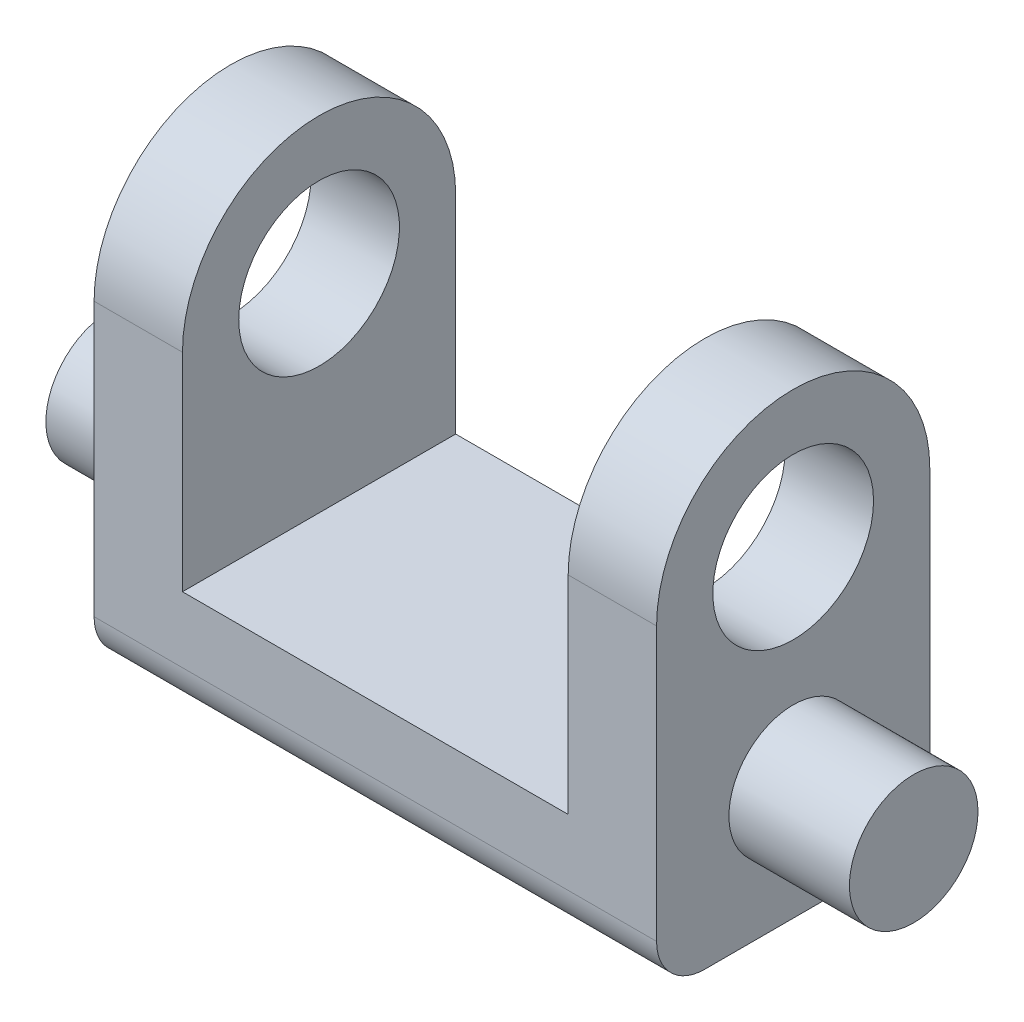
ISO-10303-21;
HEADER;
FILE_DESCRIPTION(('STEP AP214'),'2;1');
FILE_NAME('part.step','',(''),(''),'','','');
FILE_SCHEMA(('AUTOMOTIVE_DESIGN { 1 0 10303 214 1 1 1 1 }'));
ENDSEC;
DATA;
#1=APPLICATION_CONTEXT('core data for automotive mechanical design processes');
#2=APPLICATION_PROTOCOL_DEFINITION('international standard','automotive_design',2000,#1);
#3=PRODUCT_CONTEXT('',#1,'mechanical');
#4=PRODUCT('Part','Part','',(#3));
#5=PRODUCT_RELATED_PRODUCT_CATEGORY('part','',(#4));
#6=PRODUCT_DEFINITION_FORMATION('','',#4);
#7=PRODUCT_DEFINITION_CONTEXT('part definition',#1,'design');
#8=PRODUCT_DEFINITION('design','',#6,#7);
#9=PRODUCT_DEFINITION_SHAPE('','',#8);
#10=(LENGTH_UNIT() NAMED_UNIT(*) SI_UNIT(.MILLI.,.METRE.));
#11=(NAMED_UNIT(*) PLANE_ANGLE_UNIT() SI_UNIT($,.RADIAN.));
#12=(NAMED_UNIT(*) SI_UNIT($,.STERADIAN.) SOLID_ANGLE_UNIT());
#13=UNCERTAINTY_MEASURE_WITH_UNIT(LENGTH_MEASURE(1.E-05),#10,'distance_accuracy_value','');
#14=(GEOMETRIC_REPRESENTATION_CONTEXT(3) GLOBAL_UNCERTAINTY_ASSIGNED_CONTEXT((#13)) GLOBAL_UNIT_ASSIGNED_CONTEXT((#10,
#11,#12)) REPRESENTATION_CONTEXT('',''));
#15=CARTESIAN_POINT('',(0.,0.,0.));
#16=DIRECTION('',(0.,0.,1.));
#17=DIRECTION('',(1.,0.,0.));
#18=AXIS2_PLACEMENT_3D('',#15,#16,#17);
#19=CARTESIAN_POINT('',(35.,25.,0.));
#20=DIRECTION('',(-1.,0.,0.));
#21=DIRECTION('',(0.,0.,1.));
#22=AXIS2_PLACEMENT_3D('',#19,#20,#21);
#23=CYLINDRICAL_SURFACE('',#22,17.);
#24=DIRECTION('',(-1.,0.,0.));
#25=VECTOR('',#24,1.);
#26=CARTESIAN_POINT('',(35.,25.,17.));
#27=LINE('',#26,#25);
#28=CARTESIAN_POINT('',(-24.,25.,17.));
#29=VERTEX_POINT('',#28);
#30=CARTESIAN_POINT('',(-35.,25.,17.));
#31=VERTEX_POINT('',#30);
#32=EDGE_CURVE('E156',#29,#31,#27,.T.);
#33=ORIENTED_EDGE('',*,*,#32,.F.);
#34=CARTESIAN_POINT('',(-24.,25.,0.));
#35=DIRECTION('',(-1.,0.,0.));
#36=DIRECTION('',(0.,0.,1.));
#37=AXIS2_PLACEMENT_3D('',#34,#35,#36);
#38=CIRCLE('',#37,17.);
#39=CARTESIAN_POINT('',(-24.,25.,-17.));
#40=VERTEX_POINT('',#39);
#41=EDGE_CURVE('E185',#29,#40,#38,.T.);
#42=ORIENTED_EDGE('',*,*,#41,.T.);
#43=DIRECTION('',(-1.,0.,0.));
#44=VECTOR('',#43,1.);
#45=CARTESIAN_POINT('',(35.,25.,-17.));
#46=LINE('',#45,#44);
#47=CARTESIAN_POINT('',(-35.,25.,-17.));
#48=VERTEX_POINT('',#47);
#49=EDGE_CURVE('E88',#40,#48,#46,.T.);
#50=ORIENTED_EDGE('',*,*,#49,.T.);
#51=CARTESIAN_POINT('',(-35.,25.,0.));
#52=DIRECTION('',(1.,0.,0.));
#53=DIRECTION('',(0.,0.,-1.));
#54=AXIS2_PLACEMENT_3D('',#51,#52,#53);
#55=CIRCLE('',#54,17.);
#56=EDGE_CURVE('E135',#48,#31,#55,.T.);
#57=ORIENTED_EDGE('',*,*,#56,.T.);
#58=EDGE_LOOP('',(#33,#42,#50,#57));
#59=FACE_BOUND('',#58,.T.);
#60=ADVANCED_FACE('F34',(#59),#23,.T.);
#61=CARTESIAN_POINT('',(35.,25.,0.));
#62=DIRECTION('',(-1.,0.,0.));
#63=DIRECTION('',(0.,0.,1.));
#64=AXIS2_PLACEMENT_3D('',#61,#62,#63);
#65=CYLINDRICAL_SURFACE('',#64,10.);
#66=CARTESIAN_POINT('',(-24.,25.,0.));
#67=DIRECTION('',(-1.,0.,0.));
#68=DIRECTION('',(0.,0.,1.));
#69=AXIS2_PLACEMENT_3D('',#66,#67,#68);
#70=CIRCLE('',#69,10.);
#71=CARTESIAN_POINT('',(-24.,25.,10.));
#72=VERTEX_POINT('',#71);
#73=EDGE_CURVE('E38',#72,#72,#70,.T.);
#74=ORIENTED_EDGE('',*,*,#73,.F.);
#75=EDGE_LOOP('',(#74));
#76=FACE_BOUND('',#75,.T.);
#77=CARTESIAN_POINT('',(-35.,25.,0.));
#78=DIRECTION('',(1.,0.,0.));
#79=DIRECTION('',(0.,0.,-1.));
#80=AXIS2_PLACEMENT_3D('',#77,#78,#79);
#81=CIRCLE('',#80,10.);
#82=CARTESIAN_POINT('',(-35.,25.,-10.));
#83=VERTEX_POINT('',#82);
#84=EDGE_CURVE('E187',#83,#83,#81,.T.);
#85=ORIENTED_EDGE('',*,*,#84,.F.);
#86=EDGE_LOOP('',(#85));
#87=FACE_BOUND('',#86,.T.);
#88=ADVANCED_FACE('F251',(#76,#87),#65,.F.);
#89=CARTESIAN_POINT('',(50.,0.,0.));
#90=DIRECTION('',(-1.,0.,0.));
#91=DIRECTION('',(0.,0.,1.));
#92=AXIS2_PLACEMENT_3D('',#89,#90,#91);
#93=CYLINDRICAL_SURFACE('',#92,8.);
#94=CARTESIAN_POINT('',(35.,0.,0.));
#95=DIRECTION('',(1.,0.,0.));
#96=DIRECTION('',(0.,0.,-1.));
#97=AXIS2_PLACEMENT_3D('',#94,#95,#96);
#98=CIRCLE('',#97,8.);
#99=CARTESIAN_POINT('',(35.,0.,-8.));
#100=VERTEX_POINT('',#99);
#101=EDGE_CURVE('E159',#100,#100,#98,.T.);
#102=ORIENTED_EDGE('',*,*,#101,.T.);
#103=EDGE_LOOP('',(#102));
#104=FACE_BOUND('',#103,.T.);
#105=CARTESIAN_POINT('',(50.,0.,0.));
#106=DIRECTION('',(1.,0.,0.));
#107=DIRECTION('',(0.,0.,-1.));
#108=AXIS2_PLACEMENT_3D('',#105,#106,#107);
#109=CIRCLE('',#108,8.);
#110=CARTESIAN_POINT('',(50.,0.,-8.));
#111=VERTEX_POINT('',#110);
#112=EDGE_CURVE('E43',#111,#111,#109,.T.);
#113=ORIENTED_EDGE('',*,*,#112,.F.);
#114=EDGE_LOOP('',(#113));
#115=FACE_BOUND('',#114,.T.);
#116=ADVANCED_FACE('F36',(#104,#115),#93,.T.);
#117=CARTESIAN_POINT('',(50.,0.,0.));
#118=DIRECTION('',(1.,0.,0.));
#119=DIRECTION('',(0.,0.,-1.));
#120=AXIS2_PLACEMENT_3D('',#117,#118,#119);
#121=PLANE('',#120);
#122=ORIENTED_EDGE('',*,*,#112,.T.);
#123=EDGE_LOOP('',(#122));
#124=FACE_BOUND('',#123,.T.);
#125=ADVANCED_FACE('F271',(#124),#121,.T.);
#126=CARTESIAN_POINT('',(35.,25.,0.));
#127=DIRECTION('',(1.,0.,0.));
#128=DIRECTION('',(0.,0.,-1.));
#129=AXIS2_PLACEMENT_3D('',#126,#127,#128);
#130=PLANE('',#129);
#131=CARTESIAN_POINT('',(35.,25.,0.));
#132=DIRECTION('',(1.,0.,0.));
#133=DIRECTION('',(0.,0.,-1.));
#134=AXIS2_PLACEMENT_3D('',#131,#132,#133);
#135=CIRCLE('',#134,10.);
#136=CARTESIAN_POINT('',(35.,25.,-10.));
#137=VERTEX_POINT('',#136);
#138=EDGE_CURVE('E138',#137,#137,#135,.T.);
#139=ORIENTED_EDGE('',*,*,#138,.F.);
#140=EDGE_LOOP('',(#139));
#141=FACE_BOUND('',#140,.T.);
#142=CARTESIAN_POINT('',(35.,25.,0.));
#143=DIRECTION('',(1.,0.,0.));
#144=DIRECTION('',(0.,0.,-1.));
#145=AXIS2_PLACEMENT_3D('',#142,#143,#144);
#146=CIRCLE('',#145,17.);
#147=CARTESIAN_POINT('',(35.,25.,-17.));
#148=VERTEX_POINT('',#147);
#149=CARTESIAN_POINT('',(35.,25.,17.));
#150=VERTEX_POINT('',#149);
#151=EDGE_CURVE('E147',#148,#150,#146,.T.);
#152=ORIENTED_EDGE('',*,*,#151,.T.);
#153=DIRECTION('',(0.,-1.,0.));
#154=VECTOR('',#153,1.);
#155=CARTESIAN_POINT('',(35.,25.,17.));
#156=LINE('',#155,#154);
#157=CARTESIAN_POINT('',(35.,-9.,17.));
#158=VERTEX_POINT('',#157);
#159=EDGE_CURVE('E97',#150,#158,#156,.T.);
#160=ORIENTED_EDGE('',*,*,#159,.T.);
#161=CARTESIAN_POINT('',(35.,-9.,11.));
#162=DIRECTION('',(1.,0.,0.));
#163=DIRECTION('',(0.,0.,-1.));
#164=AXIS2_PLACEMENT_3D('',#161,#162,#163);
#165=CIRCLE('',#164,6.);
#166=CARTESIAN_POINT('',(35.,-15.,11.));
#167=VERTEX_POINT('',#166);
#168=EDGE_CURVE('E114',#158,#167,#165,.T.);
#169=ORIENTED_EDGE('',*,*,#168,.T.);
#170=DIRECTION('',(0.,0.,-1.));
#171=VECTOR('',#170,1.);
#172=CARTESIAN_POINT('',(35.,-15.,11.));
#173=LINE('',#172,#171);
#174=CARTESIAN_POINT('',(35.,-15.,-11.));
#175=VERTEX_POINT('',#174);
#176=EDGE_CURVE('E106',#167,#175,#173,.T.);
#177=ORIENTED_EDGE('',*,*,#176,.T.);
#178=CARTESIAN_POINT('',(35.,-9.,-11.));
#179=DIRECTION('',(1.,0.,0.));
#180=DIRECTION('',(0.,0.,-1.));
#181=AXIS2_PLACEMENT_3D('',#178,#179,#180);
#182=CIRCLE('',#181,6.);
#183=CARTESIAN_POINT('',(35.,-9.,-17.));
#184=VERTEX_POINT('',#183);
#185=EDGE_CURVE('E111',#175,#184,#182,.T.);
#186=ORIENTED_EDGE('',*,*,#185,.T.);
#187=DIRECTION('',(0.,1.,0.));
#188=VECTOR('',#187,1.);
#189=CARTESIAN_POINT('',(35.,-9.,-17.));
#190=LINE('',#189,#188);
#191=EDGE_CURVE('E60',#184,#148,#190,.T.);
#192=ORIENTED_EDGE('',*,*,#191,.T.);
#193=EDGE_LOOP('',(#152,#160,#169,#177,#186,#192));
#194=FACE_BOUND('',#193,.T.);
#195=ORIENTED_EDGE('',*,*,#101,.F.);
#196=EDGE_LOOP('',(#195));
#197=FACE_BOUND('',#196,.T.);
#198=ADVANCED_FACE('F108',(#141,#194,#197),#130,.T.);
#199=CARTESIAN_POINT('',(-35.,25.,0.));
#200=DIRECTION('',(1.,0.,0.));
#201=DIRECTION('',(0.,0.,-1.));
#202=AXIS2_PLACEMENT_3D('',#199,#200,#201);
#203=PLANE('',#202);
#204=ORIENTED_EDGE('',*,*,#84,.T.);
#205=EDGE_LOOP('',(#204));
#206=FACE_BOUND('',#205,.T.);
#207=ORIENTED_EDGE('',*,*,#56,.F.);
#208=DIRECTION('',(0.,1.,0.));
#209=VECTOR('',#208,1.);
#210=CARTESIAN_POINT('',(-35.,-9.,-17.));
#211=LINE('',#210,#209);
#212=CARTESIAN_POINT('',(-35.,-9.,-17.));
#213=VERTEX_POINT('',#212);
#214=EDGE_CURVE('E145',#213,#48,#211,.T.);
#215=ORIENTED_EDGE('',*,*,#214,.F.);
#216=CARTESIAN_POINT('',(-35.,-9.,-11.));
#217=DIRECTION('',(1.,0.,0.));
#218=DIRECTION('',(0.,0.,-1.));
#219=AXIS2_PLACEMENT_3D('',#216,#217,#218);
#220=CIRCLE('',#219,6.);
#221=CARTESIAN_POINT('',(-35.,-15.,-11.));
#222=VERTEX_POINT('',#221);
#223=EDGE_CURVE('E143',#222,#213,#220,.T.);
#224=ORIENTED_EDGE('',*,*,#223,.F.);
#225=DIRECTION('',(0.,0.,-1.));
#226=VECTOR('',#225,1.);
#227=CARTESIAN_POINT('',(-35.,-15.,11.));
#228=LINE('',#227,#226);
#229=CARTESIAN_POINT('',(-35.,-15.,11.));
#230=VERTEX_POINT('',#229);
#231=EDGE_CURVE('E123',#230,#222,#228,.T.);
#232=ORIENTED_EDGE('',*,*,#231,.F.);
#233=CARTESIAN_POINT('',(-35.,-9.,11.));
#234=DIRECTION('',(1.,0.,0.));
#235=DIRECTION('',(0.,0.,-1.));
#236=AXIS2_PLACEMENT_3D('',#233,#234,#235);
#237=CIRCLE('',#236,6.);
#238=CARTESIAN_POINT('',(-35.,-9.,17.));
#239=VERTEX_POINT('',#238);
#240=EDGE_CURVE('E140',#239,#230,#237,.T.);
#241=ORIENTED_EDGE('',*,*,#240,.F.);
#242=DIRECTION('',(0.,-1.,0.));
#243=VECTOR('',#242,1.);
#244=CARTESIAN_POINT('',(-35.,25.,17.));
#245=LINE('',#244,#243);
#246=EDGE_CURVE('E137',#31,#239,#245,.T.);
#247=ORIENTED_EDGE('',*,*,#246,.F.);
#248=EDGE_LOOP('',(#207,#215,#224,#232,#241,#247));
#249=FACE_BOUND('',#248,.T.);
#250=CARTESIAN_POINT('',(-35.,0.,0.));
#251=DIRECTION('',(1.,0.,0.));
#252=DIRECTION('',(0.,0.,-1.));
#253=AXIS2_PLACEMENT_3D('',#250,#251,#252);
#254=CIRCLE('',#253,8.);
#255=CARTESIAN_POINT('',(-35.,0.,-8.));
#256=VERTEX_POINT('',#255);
#257=EDGE_CURVE('E11',#256,#256,#254,.T.);
#258=ORIENTED_EDGE('',*,*,#257,.T.);
#259=EDGE_LOOP('',(#258));
#260=FACE_BOUND('',#259,.T.);
#261=ADVANCED_FACE('F203',(#206,#249,#260),#203,.F.);
#262=CARTESIAN_POINT('',(24.,25.,-17.));
#263=VERTEX_POINT('',#262);
#264=EDGE_CURVE('E148',#148,#263,#46,.T.);
#265=ORIENTED_EDGE('',*,*,#264,.T.);
#266=CARTESIAN_POINT('',(24.,25.,0.));
#267=DIRECTION('',(1.,0.,0.));
#268=DIRECTION('',(0.,0.,-1.));
#269=AXIS2_PLACEMENT_3D('',#266,#267,#268);
#270=CIRCLE('',#269,17.);
#271=CARTESIAN_POINT('',(24.,25.,17.));
#272=VERTEX_POINT('',#271);
#273=EDGE_CURVE('E168',#263,#272,#270,.T.);
#274=ORIENTED_EDGE('',*,*,#273,.T.);
#275=EDGE_CURVE('E157',#150,#272,#27,.T.);
#276=ORIENTED_EDGE('',*,*,#275,.F.);
#277=ORIENTED_EDGE('',*,*,#151,.F.);
#278=EDGE_LOOP('',(#265,#274,#276,#277));
#279=FACE_BOUND('',#278,.T.);
#280=ADVANCED_FACE('F211',(#279),#23,.T.);
#281=CARTESIAN_POINT('',(35.,25.,17.));
#282=DIRECTION('',(0.,0.,-1.));
#283=DIRECTION('',(0.,1.,0.));
#284=AXIS2_PLACEMENT_3D('',#281,#282,#283);
#285=PLANE('',#284);
#286=DIRECTION('',(1.,0.,0.));
#287=VECTOR('',#286,1.);
#288=CARTESIAN_POINT('',(-24.,-0.813252043947445,17.));
#289=LINE('',#288,#287);
#290=CARTESIAN_POINT('',(-24.,-0.813252043947445,17.));
#291=VERTEX_POINT('',#290);
#292=CARTESIAN_POINT('',(24.,-0.813252043947445,17.));
#293=VERTEX_POINT('',#292);
#294=EDGE_CURVE('E235',#291,#293,#289,.T.);
#295=ORIENTED_EDGE('',*,*,#294,.F.);
#296=DIRECTION('',(0.,-1.,0.));
#297=VECTOR('',#296,1.);
#298=CARTESIAN_POINT('',(-24.,-0.813252043947445,17.));
#299=LINE('',#298,#297);
#300=EDGE_CURVE('E238',#29,#291,#299,.T.);
#301=ORIENTED_EDGE('',*,*,#300,.F.);
#302=ORIENTED_EDGE('',*,*,#32,.T.);
#303=ORIENTED_EDGE('',*,*,#246,.T.);
#304=DIRECTION('',(-1.,0.,0.));
#305=VECTOR('',#304,1.);
#306=CARTESIAN_POINT('',(35.,-9.,17.));
#307=LINE('',#306,#305);
#308=EDGE_CURVE('E153',#158,#239,#307,.T.);
#309=ORIENTED_EDGE('',*,*,#308,.F.);
#310=ORIENTED_EDGE('',*,*,#159,.F.);
#311=ORIENTED_EDGE('',*,*,#275,.T.);
#312=DIRECTION('',(0.,1.,0.));
#313=VECTOR('',#312,1.);
#314=CARTESIAN_POINT('',(24.,-0.813252043947445,17.));
#315=LINE('',#314,#313);
#316=EDGE_CURVE('E182',#293,#272,#315,.T.);
#317=ORIENTED_EDGE('',*,*,#316,.F.);
#318=EDGE_LOOP('',(#295,#301,#302,#303,#309,#310,#311,#317));
#319=FACE_BOUND('',#318,.T.);
#320=ADVANCED_FACE('F196',(#319),#285,.F.);
#321=CARTESIAN_POINT('',(35.,-9.,11.));
#322=DIRECTION('',(-1.,0.,0.));
#323=DIRECTION('',(0.,0.,1.));
#324=AXIS2_PLACEMENT_3D('',#321,#322,#323);
#325=CYLINDRICAL_SURFACE('',#324,6.);
#326=ORIENTED_EDGE('',*,*,#240,.T.);
#327=DIRECTION('',(-1.,0.,0.));
#328=VECTOR('',#327,1.);
#329=CARTESIAN_POINT('',(35.,-15.,11.));
#330=LINE('',#329,#328);
#331=EDGE_CURVE('E126',#167,#230,#330,.T.);
#332=ORIENTED_EDGE('',*,*,#331,.F.);
#333=ORIENTED_EDGE('',*,*,#168,.F.);
#334=ORIENTED_EDGE('',*,*,#308,.T.);
#335=EDGE_LOOP('',(#326,#332,#333,#334));
#336=FACE_BOUND('',#335,.T.);
#337=ADVANCED_FACE('F200',(#336),#325,.T.);
#338=CARTESIAN_POINT('',(35.,-15.,11.));
#339=DIRECTION('',(0.,1.,0.));
#340=DIRECTION('',(0.,0.,1.));
#341=AXIS2_PLACEMENT_3D('',#338,#339,#340);
#342=PLANE('',#341);
#343=ORIENTED_EDGE('',*,*,#231,.T.);
#344=DIRECTION('',(-1.,0.,0.));
#345=VECTOR('',#344,1.);
#346=CARTESIAN_POINT('',(35.,-15.,-11.));
#347=LINE('',#346,#345);
#348=EDGE_CURVE('E120',#175,#222,#347,.T.);
#349=ORIENTED_EDGE('',*,*,#348,.F.);
#350=ORIENTED_EDGE('',*,*,#176,.F.);
#351=ORIENTED_EDGE('',*,*,#331,.T.);
#352=EDGE_LOOP('',(#343,#349,#350,#351));
#353=FACE_BOUND('',#352,.T.);
#354=ADVANCED_FACE('F121',(#353),#342,.F.);
#355=CARTESIAN_POINT('',(35.,-9.,-11.));
#356=DIRECTION('',(-1.,0.,0.));
#357=DIRECTION('',(0.,0.,1.));
#358=AXIS2_PLACEMENT_3D('',#355,#356,#357);
#359=CYLINDRICAL_SURFACE('',#358,6.);
#360=ORIENTED_EDGE('',*,*,#223,.T.);
#361=DIRECTION('',(-1.,0.,0.));
#362=VECTOR('',#361,1.);
#363=CARTESIAN_POINT('',(35.,-9.,-17.));
#364=LINE('',#363,#362);
#365=EDGE_CURVE('E127',#184,#213,#364,.T.);
#366=ORIENTED_EDGE('',*,*,#365,.F.);
#367=ORIENTED_EDGE('',*,*,#185,.F.);
#368=ORIENTED_EDGE('',*,*,#348,.T.);
#369=EDGE_LOOP('',(#360,#366,#367,#368));
#370=FACE_BOUND('',#369,.T.);
#371=ADVANCED_FACE('F129',(#370),#359,.T.);
#372=CARTESIAN_POINT('',(35.,-9.,-17.));
#373=DIRECTION('',(0.,0.,1.));
#374=DIRECTION('',(0.,-1.,0.));
#375=AXIS2_PLACEMENT_3D('',#372,#373,#374);
#376=PLANE('',#375);
#377=ORIENTED_EDGE('',*,*,#49,.F.);
#378=DIRECTION('',(0.,-1.,0.));
#379=VECTOR('',#378,1.);
#380=CARTESIAN_POINT('',(-24.,-0.813252043947445,-17.));
#381=LINE('',#380,#379);
#382=CARTESIAN_POINT('',(-24.,-0.813252043947445,-17.));
#383=VERTEX_POINT('',#382);
#384=EDGE_CURVE('E229',#40,#383,#381,.T.);
#385=ORIENTED_EDGE('',*,*,#384,.T.);
#386=DIRECTION('',(1.,0.,0.));
#387=VECTOR('',#386,1.);
#388=CARTESIAN_POINT('',(-24.,-0.813252043947445,-17.));
#389=LINE('',#388,#387);
#390=CARTESIAN_POINT('',(24.,-0.813252043947445,-17.));
#391=VERTEX_POINT('',#390);
#392=EDGE_CURVE('E232',#383,#391,#389,.T.);
#393=ORIENTED_EDGE('',*,*,#392,.T.);
#394=DIRECTION('',(0.,1.,0.));
#395=VECTOR('',#394,1.);
#396=CARTESIAN_POINT('',(24.,-0.813252043947445,-17.));
#397=LINE('',#396,#395);
#398=EDGE_CURVE('E51',#391,#263,#397,.T.);
#399=ORIENTED_EDGE('',*,*,#398,.T.);
#400=ORIENTED_EDGE('',*,*,#264,.F.);
#401=ORIENTED_EDGE('',*,*,#191,.F.);
#402=ORIENTED_EDGE('',*,*,#365,.T.);
#403=ORIENTED_EDGE('',*,*,#214,.T.);
#404=EDGE_LOOP('',(#377,#385,#393,#399,#400,#401,#402,#403));
#405=FACE_BOUND('',#404,.T.);
#406=ADVANCED_FACE('F207',(#405),#376,.F.);
#407=CARTESIAN_POINT('',(24.,25.,0.));
#408=DIRECTION('',(1.,0.,0.));
#409=DIRECTION('',(0.,0.,-1.));
#410=AXIS2_PLACEMENT_3D('',#407,#408,#409);
#411=CIRCLE('',#410,10.);
#412=CARTESIAN_POINT('',(24.,25.,-10.));
#413=VERTEX_POINT('',#412);
#414=EDGE_CURVE('E166',#413,#413,#411,.T.);
#415=ORIENTED_EDGE('',*,*,#414,.F.);
#416=EDGE_LOOP('',(#415));
#417=FACE_BOUND('',#416,.T.);
#418=ORIENTED_EDGE('',*,*,#138,.T.);
#419=EDGE_LOOP('',(#418));
#420=FACE_BOUND('',#419,.T.);
#421=ADVANCED_FACE('F258',(#417,#420),#65,.F.);
#422=CARTESIAN_POINT('',(-50.,0.,0.));
#423=DIRECTION('',(1.,0.,0.));
#424=DIRECTION('',(0.,0.,-1.));
#425=AXIS2_PLACEMENT_3D('',#422,#423,#424);
#426=PLANE('',#425);
#427=CARTESIAN_POINT('',(-50.,0.,0.));
#428=DIRECTION('',(1.,0.,0.));
#429=DIRECTION('',(0.,0.,-1.));
#430=AXIS2_PLACEMENT_3D('',#427,#428,#429);
#431=CIRCLE('',#430,8.);
#432=CARTESIAN_POINT('',(-50.,0.,-8.));
#433=VERTEX_POINT('',#432);
#434=EDGE_CURVE('E162',#433,#433,#431,.T.);
#435=ORIENTED_EDGE('',*,*,#434,.F.);
#436=EDGE_LOOP('',(#435));
#437=FACE_BOUND('',#436,.T.);
#438=ADVANCED_FACE('F305',(#437),#426,.F.);
#439=ORIENTED_EDGE('',*,*,#434,.T.);
#440=EDGE_LOOP('',(#439));
#441=FACE_BOUND('',#440,.T.);
#442=ORIENTED_EDGE('',*,*,#257,.F.);
#443=EDGE_LOOP('',(#442));
#444=FACE_BOUND('',#443,.T.);
#445=ADVANCED_FACE('F313',(#441,#444),#93,.T.);
#446=CARTESIAN_POINT('',(-24.,-0.813252043947445,-17.));
#447=DIRECTION('',(-1.,0.,0.));
#448=DIRECTION('',(0.,0.,1.));
#449=AXIS2_PLACEMENT_3D('',#446,#447,#448);
#450=PLANE('',#449);
#451=ORIENTED_EDGE('',*,*,#73,.T.);
#452=EDGE_LOOP('',(#451));
#453=FACE_BOUND('',#452,.T.);
#454=ORIENTED_EDGE('',*,*,#300,.T.);
#455=DIRECTION('',(0.,0.,1.));
#456=VECTOR('',#455,1.);
#457=CARTESIAN_POINT('',(-24.,-0.813252043947445,-17.));
#458=LINE('',#457,#456);
#459=EDGE_CURVE('E174',#383,#291,#458,.T.);
#460=ORIENTED_EDGE('',*,*,#459,.F.);
#461=ORIENTED_EDGE('',*,*,#384,.F.);
#462=ORIENTED_EDGE('',*,*,#41,.F.);
#463=EDGE_LOOP('',(#454,#460,#461,#462));
#464=FACE_BOUND('',#463,.T.);
#465=ADVANCED_FACE('F230',(#453,#464),#450,.F.);
#466=CARTESIAN_POINT('',(24.,-0.813252043947445,-17.));
#467=DIRECTION('',(1.,0.,0.));
#468=DIRECTION('',(0.,0.,-1.));
#469=AXIS2_PLACEMENT_3D('',#466,#467,#468);
#470=PLANE('',#469);
#471=ORIENTED_EDGE('',*,*,#414,.T.);
#472=EDGE_LOOP('',(#471));
#473=FACE_BOUND('',#472,.T.);
#474=ORIENTED_EDGE('',*,*,#398,.F.);
#475=DIRECTION('',(0.,0.,1.));
#476=VECTOR('',#475,1.);
#477=CARTESIAN_POINT('',(24.,-0.813252043947445,-17.));
#478=LINE('',#477,#476);
#479=EDGE_CURVE('E169',#391,#293,#478,.T.);
#480=ORIENTED_EDGE('',*,*,#479,.T.);
#481=ORIENTED_EDGE('',*,*,#316,.T.);
#482=ORIENTED_EDGE('',*,*,#273,.F.);
#483=EDGE_LOOP('',(#474,#480,#481,#482));
#484=FACE_BOUND('',#483,.T.);
#485=ADVANCED_FACE('F243',(#473,#484),#470,.F.);
#486=CARTESIAN_POINT('',(-24.,-0.813252043947445,-17.));
#487=DIRECTION('',(0.,-1.,0.));
#488=DIRECTION('',(0.,0.,-1.));
#489=AXIS2_PLACEMENT_3D('',#486,#487,#488);
#490=PLANE('',#489);
#491=ORIENTED_EDGE('',*,*,#294,.T.);
#492=ORIENTED_EDGE('',*,*,#479,.F.);
#493=ORIENTED_EDGE('',*,*,#392,.F.);
#494=ORIENTED_EDGE('',*,*,#459,.T.);
#495=EDGE_LOOP('',(#491,#492,#493,#494));
#496=FACE_BOUND('',#495,.T.);
#497=ADVANCED_FACE('F240',(#496),#490,.F.);
#498=CLOSED_SHELL('',(#60,#88,#116,#125,#198,#261,#280,#320,#337,#354,#371,#406,#421,#438,#445,
#465,#485,#497));
#499=MANIFOLD_SOLID_BREP('B2',#498);
#500=ADVANCED_BREP_SHAPE_REPRESENTATION('',(#18,#499),#14);
#501=SHAPE_DEFINITION_REPRESENTATION(#9,#500);
ENDSEC;
END-ISO-10303-21;
